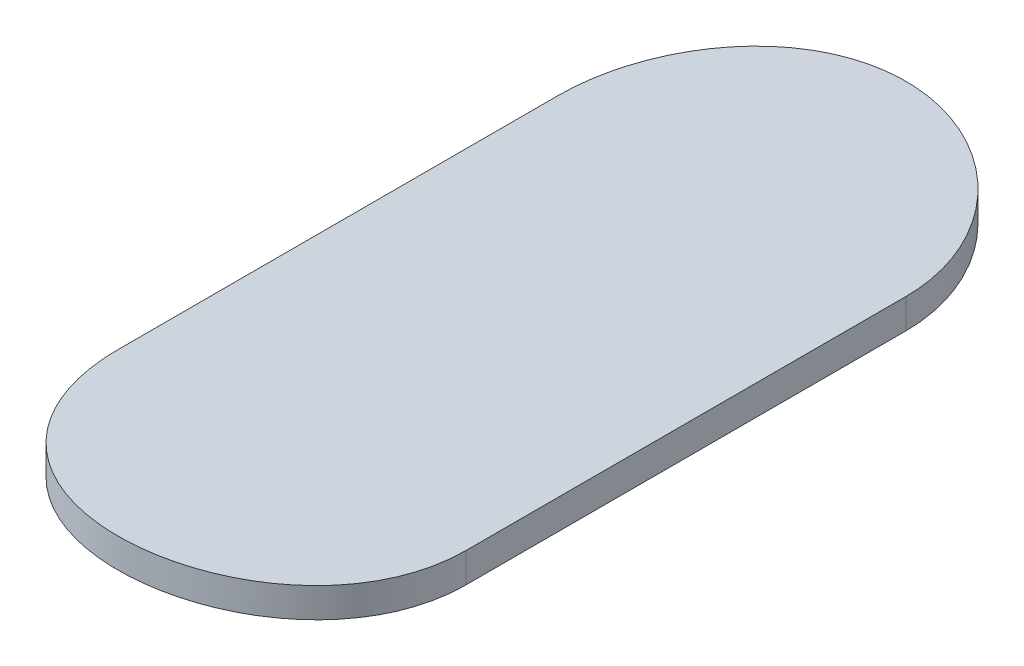
ISO-10303-21;
HEADER;
FILE_DESCRIPTION(('STEP AP214'),'2;1');
FILE_NAME('part.step','',(''),(''),'','','');
FILE_SCHEMA(('AUTOMOTIVE_DESIGN { 1 0 10303 214 1 1 1 1 }'));
ENDSEC;
DATA;
#1=APPLICATION_CONTEXT('core data for automotive mechanical design processes');
#2=APPLICATION_PROTOCOL_DEFINITION('international standard','automotive_design',2000,#1);
#3=PRODUCT_CONTEXT('',#1,'mechanical');
#4=PRODUCT('Part','Part','',(#3));
#5=PRODUCT_RELATED_PRODUCT_CATEGORY('part','',(#4));
#6=PRODUCT_DEFINITION_FORMATION('','',#4);
#7=PRODUCT_DEFINITION_CONTEXT('part definition',#1,'design');
#8=PRODUCT_DEFINITION('design','',#6,#7);
#9=PRODUCT_DEFINITION_SHAPE('','',#8);
#10=(LENGTH_UNIT() NAMED_UNIT(*) SI_UNIT(.MILLI.,.METRE.));
#11=(NAMED_UNIT(*) PLANE_ANGLE_UNIT() SI_UNIT($,.RADIAN.));
#12=(NAMED_UNIT(*) SI_UNIT($,.STERADIAN.) SOLID_ANGLE_UNIT());
#13=UNCERTAINTY_MEASURE_WITH_UNIT(LENGTH_MEASURE(1.E-05),#10,'distance_accuracy_value','');
#14=(GEOMETRIC_REPRESENTATION_CONTEXT(3) GLOBAL_UNCERTAINTY_ASSIGNED_CONTEXT((#13)) GLOBAL_UNIT_ASSIGNED_CONTEXT((#10,
#11,#12)) REPRESENTATION_CONTEXT('',''));
#15=CARTESIAN_POINT('',(0.,0.,0.));
#16=DIRECTION('',(0.,0.,1.));
#17=DIRECTION('',(1.,0.,0.));
#18=AXIS2_PLACEMENT_3D('',#15,#16,#17);
#19=CARTESIAN_POINT('',(-175.270710986936,-62.9180736437962,1.42682282483736));
#20=DIRECTION('',(0.,0.,1.));
#21=DIRECTION('',(1.,0.,0.));
#22=AXIS2_PLACEMENT_3D('',#19,#20,#21);
#23=CYLINDRICAL_SURFACE('',#22,5.);
#24=DIRECTION('',(0.,0.,1.));
#25=VECTOR('',#24,1.);
#26=CARTESIAN_POINT('',(-174.562352982167,-57.9685050830953,-0.626714267221757));
#27=LINE('',#26,#25);
#28=CARTESIAN_POINT('',(-174.562352982167,-57.9685050830953,-0.626714267221755));
#29=VERTEX_POINT('',#28);
#30=CARTESIAN_POINT('',(-174.562352982167,-57.9685050830953,-2.41765714717988));
#31=VERTEX_POINT('',#30);
#32=EDGE_CURVE('E72',#29,#31,#27,.F.);
#33=ORIENTED_EDGE('',*,*,#32,.T.);
#34=CARTESIAN_POINT('',(-175.979068991686,-57.9685050830924,-2.41765714717988));
#35=CARTESIAN_POINT('',(-175.979103782239,-57.9685236247254,-2.45729586745356));
#36=CARTESIAN_POINT('',(-175.975743993142,-57.9680294172961,-2.49691993696249));
#37=CARTESIAN_POINT('',(-175.962497293196,-57.966153634488,-2.5749954833038));
#38=CARTESIAN_POINT('',(-175.952617865063,-57.96477307644,-2.61344825159392));
#39=CARTESIAN_POINT('',(-175.926588847079,-57.9612615989124,-2.68814519526371));
#40=CARTESIAN_POINT('',(-175.910437338651,-57.9591304498517,-2.72438869091643));
#41=CARTESIAN_POINT('',(-175.872343788952,-57.9543645974186,-2.7936493420057));
#42=CARTESIAN_POINT('',(-175.850402245911,-57.9517299373782,-2.82666677470829));
#43=CARTESIAN_POINT('',(-175.801186212379,-57.9462318835381,-2.88876949527429));
#44=CARTESIAN_POINT('',(-175.773879485931,-57.9433671722797,-2.91782912168113));
#45=CARTESIAN_POINT('',(-175.714767078786,-57.9377429193244,-2.97097927617981));
#46=CARTESIAN_POINT('',(-175.682959727318,-57.9349834171695,-2.99506795069902));
#47=CARTESIAN_POINT('',(-175.615578010275,-57.9298662750011,-3.0376852821794));
#48=CARTESIAN_POINT('',(-175.579986710165,-57.9275105763355,-3.05618738804306));
#49=CARTESIAN_POINT('',(-175.50618961077,-57.923485599968,-3.08692159941246));
#50=CARTESIAN_POINT('',(-175.46798693738,-57.9218155177829,-3.09916105751459));
#51=CARTESIAN_POINT('',(-175.403100429486,-57.9197589158793,-3.11404347452354));
#52=CARTESIAN_POINT('',(-175.376831486473,-57.9191299886342,-3.11852632443478));
#53=CARTESIAN_POINT('',(-175.323949150309,-57.9182871387536,-3.12451275416965));
#54=CARTESIAN_POINT('',(-175.297335753281,-57.9180732207935,-3.12601630042862));
#55=CARTESIAN_POINT('',(-175.23113654507,-57.9180742725377,-3.12601344485146));
#56=CARTESIAN_POINT('',(-175.191536984771,-57.9185484483598,-3.12268739044453));
#57=CARTESIAN_POINT('',(-175.113441963008,-57.9203944948015,-3.10947297709185));
#58=CARTESIAN_POINT('',(-175.074947697749,-57.9217673023731,-3.09957776871187));
#59=CARTESIAN_POINT('',(-175.00020677382,-57.9252561689579,-3.07352532423212));
#60=CARTESIAN_POINT('',(-174.963958447437,-57.9273716685143,-3.05737280071219));
#61=CARTESIAN_POINT('',(-174.894692648647,-57.9321116511947,-3.01927472047695));
#62=CARTESIAN_POINT('',(-174.861674711803,-57.9347360609899,-2.99732999819422));
#63=CARTESIAN_POINT('',(-174.799570755551,-57.9402220719575,-2.94810754576659));
#64=CARTESIAN_POINT('',(-174.770510529491,-57.9430850497234,-2.92079742410643));
#65=CARTESIAN_POINT('',(-174.717368000384,-57.9487147875815,-2.861686582218));
#66=CARTESIAN_POINT('',(-174.693286168052,-57.9514815385548,-2.82988543783347));
#67=CARTESIAN_POINT('',(-174.6506815258,-57.9566194521665,-2.76252035496249));
#68=CARTESIAN_POINT('',(-174.632184904988,-57.9589887286848,-2.72693971569602));
#69=CARTESIAN_POINT('',(-174.601448250876,-57.9630429435686,-2.65314302634224));
#70=CARTESIAN_POINT('',(-174.589204591519,-57.9647282784312,-2.61492851824721));
#71=CARTESIAN_POINT('',(-174.57431847833,-57.966803740856,-2.55001546572358));
#72=CARTESIAN_POINT('',(-174.569835231589,-57.9674384398505,-2.52373211165115));
#73=CARTESIAN_POINT('',(-174.563852298162,-57.9682904852839,-2.47085548452038));
#74=CARTESIAN_POINT('',(-174.562348814522,-57.9685083628437,-2.44426264936115));
#75=CARTESIAN_POINT('',(-174.562352982166,-57.9685050830953,-2.41765714717989));
#76=B_SPLINE_CURVE_WITH_KNOTS('',3,(#34,#35,#36,#37,#38,#39,#40,#41,#42,#43,#44,#45,#46,#47,#48,
#49,#50,#51,#52,#53,#54,#55,#56,#57,#58,#59,#60,#61,#62,#63,#64,#65,#66,#67,#68,#69,#70,#71,#72,
#73,#74,#75),.UNSPECIFIED.,.F.,.F.,(4,2,2,2,2,2,2,2,2,2,2,2,2,2,2,2,2,2,2,2,4),(0.,
0.118749159033301,0.237362263863266,0.356011680082907,0.474650889915931,0.594026017222665,
0.713445577112569,0.833424074530632,0.953261387365861,1.03306921841363,1.11287794856634,
1.23150381401026,1.35025356129366,1.46891404775443,1.58755744913422,1.70694043541029,
1.82633470440586,1.94628041824212,2.0661564970343,2.14600710616939,2.22575590036766),.UNSPECIFIED.);
#77=CARTESIAN_POINT('',(-175.979068991686,-57.9685050830924,-2.41765714717988));
#78=VERTEX_POINT('',#77);
#79=EDGE_CURVE('E21',#78,#31,#76,.T.);
#80=ORIENTED_EDGE('',*,*,#79,.F.);
#81=DIRECTION('',(0.,0.,1.));
#82=VECTOR('',#81,1.);
#83=CARTESIAN_POINT('',(-175.979068991686,-57.9685050830924,-2.41765714717988));
#84=LINE('',#83,#82);
#85=CARTESIAN_POINT('',(-175.979068991686,-57.9685050830924,-0.626714267221757));
#86=VERTEX_POINT('',#85);
#87=EDGE_CURVE('E59',#78,#86,#84,.T.);
#88=ORIENTED_EDGE('',*,*,#87,.T.);
#89=CARTESIAN_POINT('',(-174.562352982166,-57.9685050830953,-0.626714267221757));
#90=CARTESIAN_POINT('',(-174.562318196855,-57.9685236249812,-0.587075440803487));
#91=CARTESIAN_POINT('',(-174.565678001328,-57.9680294147793,-0.547451265399244));
#92=CARTESIAN_POINT('',(-174.578924730807,-57.9661536270469,-0.469375725013029));
#93=CARTESIAN_POINT('',(-174.588804138273,-57.9647730715819,-0.430923062558441));
#94=CARTESIAN_POINT('',(-174.614832862513,-57.961261635449,-0.356226993143532));
#95=CARTESIAN_POINT('',(-174.630983984776,-57.9591305387335,-0.319984225841986));
#96=CARTESIAN_POINT('',(-174.669077252271,-57.9543647067664,-0.250723448485018));
#97=CARTESIAN_POINT('',(-174.69101913913,-57.9517299939867,-0.217705294642918));
#98=CARTESIAN_POINT('',(-174.740238554018,-57.9462315808069,-0.155598483974617));
#99=CARTESIAN_POINT('',(-174.767548788612,-57.9433665437923,-0.126535861606939));
#100=CARTESIAN_POINT('',(-174.826661623317,-57.9377423080897,-0.073386854809153));
#101=CARTESIAN_POINT('',(-174.858464907965,-57.9349831256108,-0.0493012300298593));
#102=CARTESIAN_POINT('',(-174.92582690985,-57.9298676599314,-0.00669747101996764));
#103=CARTESIAN_POINT('',(-174.961401022296,-57.92751314,0.011796551308946));
#104=CARTESIAN_POINT('',(-175.035187236117,-57.923487367333,0.0425365416853546));
#105=CARTESIAN_POINT('',(-175.073399058509,-57.9218160424669,0.0547831693543114));
#106=CARTESIAN_POINT('',(-175.151106698599,-57.9193542972137,0.0726027061891423));
#107=CARTESIAN_POINT('',(-175.190592217577,-57.9185580590577,0.0782197092633167));
#108=CARTESIAN_POINT('',(-175.269953805239,-57.9179162798542,0.082757402555478));
#109=CARTESIAN_POINT('',(-175.309829863807,-57.9180707142472,0.0816782657608135));
#110=CARTESIAN_POINT('',(-175.388537947523,-57.9193082454885,0.0728890572939428));
#111=CARTESIAN_POINT('',(-175.427375409613,-57.920384673506,0.0652266019072342));
#112=CARTESIAN_POINT('',(-175.503207417969,-57.9233377917455,0.0435629378048156));
#113=CARTESIAN_POINT('',(-175.540201931684,-57.9252144960957,0.029561617180855));
#114=CARTESIAN_POINT('',(-175.611444073484,-57.9295688237722,-0.00443201761325129));
#115=CARTESIAN_POINT('',(-175.645681859745,-57.9320484831862,-0.0244446862414564));
#116=CARTESIAN_POINT('',(-175.710329759436,-57.9373318406016,-0.0698773123927007));
#117=CARTESIAN_POINT('',(-175.74073980229,-57.9401355445759,-0.0952973695927754));
#118=CARTESIAN_POINT('',(-175.797147098611,-57.9457827135757,-0.15108498007796));
#119=CARTESIAN_POINT('',(-175.82310390147,-57.948626312746,-0.181493431431639));
#120=CARTESIAN_POINT('',(-175.869559674625,-57.9540098748136,-0.246267479357012));
#121=CARTESIAN_POINT('',(-175.890057049346,-57.9565497488248,-0.280634228587439));
#122=CARTESIAN_POINT('',(-175.925016270059,-57.961038558067,-0.352394026502317));
#123=CARTESIAN_POINT('',(-175.939470714414,-57.9629867678086,-0.389790719883947));
#124=CARTESIAN_POINT('',(-175.961861661342,-57.9660598482314,-0.466488015576317));
#125=CARTESIAN_POINT('',(-175.969807949566,-57.9671859547474,-0.505785665031375));
#126=CARTESIAN_POINT('',(-175.975949999032,-57.9680595995501,-0.558929092149745));
#127=CARTESIAN_POINT('',(-175.977120153473,-57.9682265264066,-0.572471186339163));
#128=CARTESIAN_POINT('',(-175.978678612888,-57.9684491444337,-0.599578341048425));
#129=CARTESIAN_POINT('',(-175.979068231016,-57.9685050224287,-0.613143324503866));
#130=CARTESIAN_POINT('',(-175.979068991686,-57.9685050830924,-0.626714267221754));
#131=B_SPLINE_CURVE_WITH_KNOTS('',3,(#89,#90,#91,#92,#93,#94,#95,#96,#97,#98,#99,#100,#101,#102,
#103,#104,#105,#106,#107,#108,#109,#110,#111,#112,#113,#114,#115,#116,#117,#118,#119,#120,#121,
#122,#123,#124,#125,#126,#127,#128,#129,#130),.UNSPECIFIED.,.F.,.F.,(4,2,2,2,2,2,2,2,2,2,2,2,2,
2,2,2,2,2,2,2,4),(0.,0.118749475652924,0.237362263855803,0.356009223373558,0.474650889962754,
0.594039129072917,0.713445577251872,0.833359813547291,0.953261386262482,1.07236091244362,
1.19145736183337,1.30969958496657,1.42794389566527,1.54659318409004,1.66524465982466,
1.78492258189405,1.90463544277968,2.02449450646762,2.14417301772137,2.18493687446288,
2.22563209338629),.UNSPECIFIED.);
#132=EDGE_CURVE('E73',#29,#86,#131,.T.);
#133=ORIENTED_EDGE('',*,*,#132,.F.);
#134=EDGE_LOOP('',(#33,#80,#88,#133));
#135=FACE_BOUND('',#134,.T.);
#136=ADVANCED_FACE('F17',(#135),#23,.T.);
#137=CARTESIAN_POINT('',(-174.562352982167,-67.7980736437962,-0.626714267221757));
#138=DIRECTION('',(-1.,0.,0.));
#139=DIRECTION('',(0.,0.,1.));
#140=AXIS2_PLACEMENT_3D('',#137,#138,#139);
#141=PLANE('',#140);
#142=DIRECTION('',(0.,0.,1.));
#143=VECTOR('',#142,1.);
#144=CARTESIAN_POINT('',(-174.562352982167,-58.0897583126399,1.42682282483736));
#145=LINE('',#144,#143);
#146=CARTESIAN_POINT('',(-174.562352982167,-58.0897583126399,-0.626714267221756));
#147=VERTEX_POINT('',#146);
#148=CARTESIAN_POINT('',(-174.562352982166,-58.0897583126399,-2.41765714717988));
#149=VERTEX_POINT('',#148);
#150=EDGE_CURVE('E80',#147,#149,#145,.F.);
#151=ORIENTED_EDGE('',*,*,#150,.T.);
#152=DIRECTION('',(0.,-1.,0.));
#153=VECTOR('',#152,1.);
#154=CARTESIAN_POINT('',(-174.562352982166,-67.7980736437962,-2.41765714717988));
#155=LINE('',#154,#153);
#156=EDGE_CURVE('E67',#31,#149,#155,.T.);
#157=ORIENTED_EDGE('',*,*,#156,.F.);
#158=ORIENTED_EDGE('',*,*,#32,.F.);
#159=DIRECTION('',(0.,-1.,0.));
#160=VECTOR('',#159,1.);
#161=CARTESIAN_POINT('',(-174.562352982166,-67.7980736437962,-0.626714267221758));
#162=LINE('',#161,#160);
#163=EDGE_CURVE('E106',#147,#29,#162,.F.);
#164=ORIENTED_EDGE('',*,*,#163,.F.);
#165=EDGE_LOOP('',(#151,#157,#158,#164));
#166=FACE_BOUND('',#165,.T.);
#167=ADVANCED_FACE('F79',(#166),#141,.F.);
#168=CARTESIAN_POINT('',(-175.270710986926,-67.7980736437962,-2.41765714717988));
#169=DIRECTION('',(0.,-1.,0.));
#170=DIRECTION('',(0.,0.,-1.));
#171=AXIS2_PLACEMENT_3D('',#168,#169,#170);
#172=CYLINDRICAL_SURFACE('',#171,0.70835800475956);
#173=CARTESIAN_POINT('',(-174.562352982166,-58.0897583126399,-2.41765714717988));
#174=CARTESIAN_POINT('',(-174.562318145192,-58.0897773193201,-2.45728532548055));
#175=CARTESIAN_POINT('',(-174.565676203015,-58.08927096035,-2.49689862464216));
#176=CARTESIAN_POINT('',(-174.578915443137,-58.0873491673323,-2.57495175748994));
#177=CARTESIAN_POINT('',(-174.588789010642,-58.0859347945491,-2.61339290628645));
#178=CARTESIAN_POINT('',(-174.614801587028,-58.0823374833905,-2.68806671186261));
#179=CARTESIAN_POINT('',(-174.630942457541,-58.0801543166715,-2.72429870873505));
#180=CARTESIAN_POINT('',(-174.669010037604,-58.0752722557907,-2.79353868796137));
#181=CARTESIAN_POINT('',(-174.690936293546,-58.0725734020663,-2.82654692279896));
#182=CARTESIAN_POINT('',(-174.740125485577,-58.0669404371566,-2.88864495363578));
#183=CARTESIAN_POINT('',(-174.767422266731,-58.0640049075348,-2.91770781371458));
#184=CARTESIAN_POINT('',(-174.82651525976,-58.0582413500385,-2.97086688228522));
#185=CARTESIAN_POINT('',(-174.858313140636,-58.0554133625363,-2.9949612402855));
#186=CARTESIAN_POINT('',(-174.925685273022,-58.0501681877257,-3.03759732535105));
#187=CARTESIAN_POINT('',(-174.961277260925,-58.0477530806871,-3.05611127329629));
#188=CARTESIAN_POINT('',(-175.035079792095,-58.0436261621541,-3.0868683031817));
#189=CARTESIAN_POINT('',(-175.07328720302,-58.0419135259697,-3.09911874257559));
#190=CARTESIAN_POINT('',(-175.138202076931,-58.0398034946585,-3.11402166181831));
#191=CARTESIAN_POINT('',(-175.16449415223,-58.0391579362257,-3.11851265250552));
#192=CARTESIAN_POINT('',(-175.217424022199,-58.0382927919898,-3.12450998863529));
#193=CARTESIAN_POINT('',(-175.244061820581,-58.0380732107632,-3.12601630201213));
#194=CARTESIAN_POINT('',(-175.310274654982,-58.0380742866822,-3.12601344452789));
#195=CARTESIAN_POINT('',(-175.349863378852,-58.0385598569111,-3.12268917863141));
#196=CARTESIAN_POINT('',(-175.427936533766,-58.0404502747864,-3.10948220461771));
#197=CARTESIAN_POINT('',(-175.466419770955,-58.0418560799469,-3.09959266511276));
#198=CARTESIAN_POINT('',(-175.541138489993,-58.0454288657007,-3.07355615384111));
#199=CARTESIAN_POINT('',(-175.577375672869,-58.0475952617715,-3.05741398630721));
#200=CARTESIAN_POINT('',(-175.646621247396,-58.0524495488446,-3.01934128292261));
#201=CARTESIAN_POINT('',(-175.679630093273,-58.055137366324,-2.99741156298771));
#202=CARTESIAN_POINT('',(-175.741729067073,-58.0607573211743,-2.94821568978998));
#203=CARTESIAN_POINT('',(-175.770792178326,-58.063690940301,-2.92091560160108));
#204=CARTESIAN_POINT('',(-175.823942987292,-58.0694603501512,-2.86182445326015));
#205=CARTESIAN_POINT('',(-175.848030209036,-58.0722961314945,-2.83003296397207));
#206=CARTESIAN_POINT('',(-175.890653310522,-58.0775636929584,-2.76267758362815));
#207=CARTESIAN_POINT('',(-175.909161713932,-58.0799934480326,-2.72709615278291));
#208=CARTESIAN_POINT('',(-175.939921017347,-58.0841518042721,-2.653293913878));
#209=CARTESIAN_POINT('',(-175.952175565706,-58.0858808141145,-2.61507465947233));
#210=CARTESIAN_POINT('',(-175.96708191367,-58.0880111303492,-2.5501336371719));
#211=CARTESIAN_POINT('',(-175.97157317901,-58.0886629126216,-2.52382757904234));
#212=CARTESIAN_POINT('',(-175.977566939665,-58.0895379244265,-2.47090401199245));
#213=CARTESIAN_POINT('',(-175.979073204289,-58.089761694419,-2.44428693860738));
#214=CARTESIAN_POINT('',(-175.979068991686,-58.089758312637,-2.41765714717988));
#215=B_SPLINE_CURVE_WITH_KNOTS('',3,(#173,#174,#175,#176,#177,#178,#179,#180,#181,#182,#183,
#184,#185,#186,#187,#188,#189,#190,#191,#192,#193,#194,#195,#196,#197,#198,#199,#200,#201,#202,
#203,#204,#205,#206,#207,#208,#209,#210,#211,#212,#213,#214),.UNSPECIFIED.,.F.,.F.,(4,2,2,2,2,2,
2,2,2,2,2,2,2,2,2,2,2,2,2,2,4),(0.,0.118717120276493,0.237295738850518,0.355909606852675,
0.474514177602681,0.593891627579886,0.713313459053198,0.833320307373828,0.953185863457887,
1.03306677770104,1.11294855013581,1.23154197581433,1.35025899575979,1.46888497935198,
1.58749424825162,1.70687857869044,1.82627432356575,1.94624884332542,2.06615329248612,
2.14607569142816,2.22589710390241),.UNSPECIFIED.);
#216=CARTESIAN_POINT('',(-175.979068991686,-58.089758312637,-2.41765714717988));
#217=VERTEX_POINT('',#216);
#218=EDGE_CURVE('E91',#149,#217,#215,.T.);
#219=ORIENTED_EDGE('',*,*,#218,.T.);
#220=DIRECTION('',(0.,1.,0.));
#221=VECTOR('',#220,1.);
#222=CARTESIAN_POINT('',(-175.979068991686,-67.7980736437962,-2.41765714717988));
#223=LINE('',#222,#221);
#224=EDGE_CURVE('E69',#217,#78,#223,.T.);
#225=ORIENTED_EDGE('',*,*,#224,.T.);
#226=ORIENTED_EDGE('',*,*,#79,.T.);
#227=ORIENTED_EDGE('',*,*,#156,.T.);
#228=EDGE_LOOP('',(#219,#225,#226,#227));
#229=FACE_BOUND('',#228,.T.);
#230=ADVANCED_FACE('F65',(#229),#172,.T.);
#231=CARTESIAN_POINT('',(-175.979068991686,-67.7980736437962,-2.41765714717988));
#232=DIRECTION('',(1.,0.,0.));
#233=DIRECTION('',(0.,1.,0.));
#234=AXIS2_PLACEMENT_3D('',#231,#232,#233);
#235=PLANE('',#234);
#236=DIRECTION('',(0.,0.,1.));
#237=VECTOR('',#236,1.);
#238=CARTESIAN_POINT('',(-175.979068991686,-58.089758312637,1.42682282483736));
#239=LINE('',#238,#237);
#240=CARTESIAN_POINT('',(-175.979068991686,-58.089758312637,-0.626714267221757));
#241=VERTEX_POINT('',#240);
#242=EDGE_CURVE('E31',#217,#241,#239,.T.);
#243=ORIENTED_EDGE('',*,*,#242,.T.);
#244=DIRECTION('',(0.,-1.,0.));
#245=VECTOR('',#244,1.);
#246=CARTESIAN_POINT('',(-175.979068991686,-67.7980736437962,-0.626714267221758));
#247=LINE('',#246,#245);
#248=EDGE_CURVE('E39',#86,#241,#247,.T.);
#249=ORIENTED_EDGE('',*,*,#248,.F.);
#250=ORIENTED_EDGE('',*,*,#87,.F.);
#251=ORIENTED_EDGE('',*,*,#224,.F.);
#252=EDGE_LOOP('',(#243,#249,#250,#251));
#253=FACE_BOUND('',#252,.T.);
#254=ADVANCED_FACE('F101',(#253),#235,.F.);
#255=CARTESIAN_POINT('',(-175.270710986926,-67.7980736437962,-0.626714267221757));
#256=DIRECTION('',(0.,-1.,0.));
#257=DIRECTION('',(0.,0.,-1.));
#258=AXIS2_PLACEMENT_3D('',#255,#256,#257);
#259=CYLINDRICAL_SURFACE('',#258,0.708358004759557);
#260=ORIENTED_EDGE('',*,*,#248,.T.);
#261=CARTESIAN_POINT('',(-175.979068991686,-58.089758312637,-0.626714267221757));
#262=CARTESIAN_POINT('',(-175.979103823422,-58.089777319574,-0.587085984664458));
#263=CARTESIAN_POINT('',(-175.975745750546,-58.0892709578118,-0.547472581488798));
#264=CARTESIAN_POINT('',(-175.962506481514,-58.0873491598355,-0.469419454489702));
#265=CARTESIAN_POINT('',(-175.95263293435,-58.0859347896514,-0.430978409645974));
#266=CARTESIAN_POINT('',(-175.926620649955,-58.0823375206806,-0.356305473530787));
#267=CARTESIAN_POINT('',(-175.910480163927,-58.080154407391,-0.320074202167776));
#268=CARTESIAN_POINT('',(-175.872412864946,-58.0752723673979,-0.250834097224405));
#269=CARTESIAN_POINT('',(-175.850486266801,-58.0725734598442,-0.2178251440781));
#270=CARTESIAN_POINT('',(-175.801293703093,-58.0669401276507,-0.155723033178362));
#271=CARTESIAN_POINT('',(-175.773993422692,-58.0640042649696,-0.126657183513235));
#272=CARTESIAN_POINT('',(-175.714900003614,-58.0582407250715,-0.0734992595682298));
#273=CARTESIAN_POINT('',(-175.683106180024,-58.0554130644304,-0.0494079448946428));
#274=CARTESIAN_POINT('',(-175.615753729842,-58.0501696054497,-0.00678541839147861));
#275=CARTESIAN_POINT('',(-175.580178905353,-58.0477557051986,0.0117204509505996));
#276=CARTESIAN_POINT('',(-175.506387254001,-58.0436279722352,0.0424832521613828));
#277=CARTESIAN_POINT('',(-175.468170712112,-58.0419140641492,0.0547408568646938));
#278=CARTESIAN_POINT('',(-175.39046313538,-58.0393894670185,0.0725771305907536));
#279=CARTESIAN_POINT('',(-175.35098292746,-58.0385725234619,0.0782020696646632));
#280=CARTESIAN_POINT('',(-175.271630174833,-58.0379124748554,0.0827569850264986));
#281=CARTESIAN_POINT('',(-175.231757641233,-58.0380693423135,0.0816871503171208));
#282=CARTESIAN_POINT('',(-175.153069673762,-58.0393342663878,0.072919276261968));
#283=CARTESIAN_POINT('',(-175.114248541565,-58.0404351533811,0.0652711959297919));
#284=CARTESIAN_POINT('',(-175.03844682072,-58.0434564145514,0.0436423239920053));
#285=CARTESIAN_POINT('',(-175.001466266198,-58.0453768039163,0.0296614150178547));
#286=CARTESIAN_POINT('',(-174.930242628722,-58.0498336710433,-0.00428807522332249));
#287=CARTESIAN_POINT('',(-174.896009823764,-58.0523723305698,-0.0242779208018462));
#288=CARTESIAN_POINT('',(-174.831367065206,-58.0577824317954,-0.0696615660811913));
#289=CARTESIAN_POINT('',(-174.800957194745,-58.0606538807293,-0.095055483276591));
#290=CARTESIAN_POINT('',(-174.744531485747,-58.0664400559038,-0.150801090364875));
#291=CARTESIAN_POINT('',(-174.718558087852,-58.0693549382976,-0.181195735600882));
#292=CARTESIAN_POINT('',(-174.672066609499,-58.0748748078838,-0.245945996404078));
#293=CARTESIAN_POINT('',(-174.651550118273,-58.0774797046763,-0.28030276170461));
#294=CARTESIAN_POINT('',(-174.616549952037,-58.0820849560942,-0.352049620468132));
#295=CARTESIAN_POINT('',(-174.602074000494,-58.0840845358671,-0.389443524738233));
#296=CARTESIAN_POINT('',(-174.579640553982,-58.0872401588722,-0.466140821924035));
#297=CARTESIAN_POINT('',(-174.571673278662,-58.088397467468,-0.505441255467612));
#298=CARTESIAN_POINT('',(-174.565498181792,-58.0892978114293,-0.558645528412095));
#299=CARTESIAN_POINT('',(-174.564318200676,-58.0894703629799,-0.572244014577337));
#300=CARTESIAN_POINT('',(-174.562746644232,-58.0897004871427,-0.599464474620663));
#301=CARTESIAN_POINT('',(-174.56235374427,-58.0897582529345,-0.613086370355156));
#302=CARTESIAN_POINT('',(-174.562352982166,-58.0897583126399,-0.626714267221757));
#303=B_SPLINE_CURVE_WITH_KNOTS('',3,(#261,#262,#263,#264,#265,#266,#267,#268,#269,#270,#271,
#272,#273,#274,#275,#276,#277,#278,#279,#280,#281,#282,#283,#284,#285,#286,#287,#288,#289,#290,
#291,#292,#293,#294,#295,#296,#297,#298,#299,#300,#301,#302),.UNSPECIFIED.,.F.,.F.,(4,2,2,2,2,2,
2,2,2,2,2,2,2,2,2,2,2,2,2,2,4),(0.,0.118717431269429,0.237295738843079,0.355907159656692,
0.474514177652006,0.593904709750237,0.71331345919796,0.833256120025154,0.953185862284587,
1.07227391925402,1.19135861421855,1.30954681700366,1.42773721030193,1.5463508783698,
1.66496712558317,1.78466126314284,1.90439022152268,2.02427180038265,2.14397290448866,
2.18490777514715,2.22577369557208),.UNSPECIFIED.);
#304=EDGE_CURVE('E11',#241,#147,#303,.T.);
#305=ORIENTED_EDGE('',*,*,#304,.T.);
#306=ORIENTED_EDGE('',*,*,#163,.T.);
#307=ORIENTED_EDGE('',*,*,#132,.T.);
#308=EDGE_LOOP('',(#260,#305,#306,#307));
#309=FACE_BOUND('',#308,.T.);
#310=ADVANCED_FACE('F97',(#309),#259,.T.);
#311=CARTESIAN_POINT('',(-175.270710986936,-62.9180736437962,1.42682282483736));
#312=DIRECTION('',(0.,0.,1.));
#313=DIRECTION('',(1.,0.,0.));
#314=AXIS2_PLACEMENT_3D('',#311,#312,#313);
#315=CYLINDRICAL_SURFACE('',#314,4.88);
#316=ORIENTED_EDGE('',*,*,#242,.F.);
#317=ORIENTED_EDGE('',*,*,#218,.F.);
#318=ORIENTED_EDGE('',*,*,#150,.F.);
#319=ORIENTED_EDGE('',*,*,#304,.F.);
#320=EDGE_LOOP('',(#316,#317,#318,#319));
#321=FACE_BOUND('',#320,.T.);
#322=ADVANCED_FACE('F95',(#321),#315,.F.);
#323=CLOSED_SHELL('',(#136,#167,#230,#254,#310,#322));
#324=MANIFOLD_SOLID_BREP('B1',#323);
#325=ADVANCED_BREP_SHAPE_REPRESENTATION('',(#18,#324),#14);
#326=SHAPE_DEFINITION_REPRESENTATION(#9,#325);
ENDSEC;
END-ISO-10303-21;
